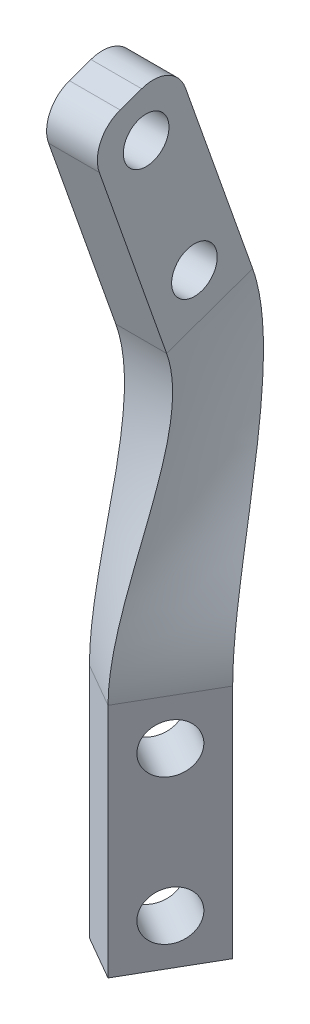
ISO-10303-21;
HEADER;
FILE_DESCRIPTION(('STEP AP214'),'2;1');
FILE_NAME('part.step','',(''),(''),'','','');
FILE_SCHEMA(('AUTOMOTIVE_DESIGN { 1 0 10303 214 1 1 1 1 }'));
ENDSEC;
DATA;
#1=APPLICATION_CONTEXT('core data for automotive mechanical design processes');
#2=APPLICATION_PROTOCOL_DEFINITION('international standard','automotive_design',2000,#1);
#3=PRODUCT_CONTEXT('',#1,'mechanical');
#4=PRODUCT('Part','Part','',(#3));
#5=PRODUCT_RELATED_PRODUCT_CATEGORY('part','',(#4));
#6=PRODUCT_DEFINITION_FORMATION('','',#4);
#7=PRODUCT_DEFINITION_CONTEXT('part definition',#1,'design');
#8=PRODUCT_DEFINITION('design','',#6,#7);
#9=PRODUCT_DEFINITION_SHAPE('','',#8);
#10=(LENGTH_UNIT() NAMED_UNIT(*) SI_UNIT(.MILLI.,.METRE.));
#11=(NAMED_UNIT(*) PLANE_ANGLE_UNIT() SI_UNIT($,.RADIAN.));
#12=(NAMED_UNIT(*) SI_UNIT($,.STERADIAN.) SOLID_ANGLE_UNIT());
#13=UNCERTAINTY_MEASURE_WITH_UNIT(LENGTH_MEASURE(1.E-05),#10,'distance_accuracy_value','');
#14=(GEOMETRIC_REPRESENTATION_CONTEXT(3) GLOBAL_UNCERTAINTY_ASSIGNED_CONTEXT((#13)) GLOBAL_UNIT_ASSIGNED_CONTEXT((#10,
#11,#12)) REPRESENTATION_CONTEXT('',''));
#15=CARTESIAN_POINT('',(0.,0.,0.));
#16=DIRECTION('',(0.,0.,1.));
#17=DIRECTION('',(1.,0.,0.));
#18=AXIS2_PLACEMENT_3D('',#15,#16,#17);
#19=CARTESIAN_POINT('',(-105.348860829014,1.44942155266481E-13,-60.8231931584518));
#20=DIRECTION('',(0.866025403784439,0.,0.5));
#21=DIRECTION('',(-0.5,0.,0.866025403784439));
#22=AXIS2_PLACEMENT_3D('',#19,#20,#21);
#23=PLANE('',#22);
#24=CARTESIAN_POINT('',(-190.650199856967,-33.4932998807614,86.9230599916197));
#25=DIRECTION('',(-0.866025403784438,0.,-0.500000000000001));
#26=DIRECTION('',(-0.500000000000001,0.,0.866025403784438));
#27=AXIS2_PLACEMENT_3D('',#24,#25,#26);
#28=CIRCLE('',#27,2.15000000000004);
#29=CARTESIAN_POINT('',(-191.725199856967,-33.4932998807614,88.7850146097563));
#30=VERTEX_POINT('',#29);
#31=EDGE_CURVE('E276',#30,#30,#28,.T.);
#32=ORIENTED_EDGE('',*,*,#31,.T.);
#33=EDGE_LOOP('',(#32));
#34=FACE_BOUND('',#33,.T.);
#35=DIRECTION('',(0.,-1.,0.));
#36=VECTOR('',#35,1.);
#37=CARTESIAN_POINT('',(-188.650199856967,-16.7932998807614,83.4589583764819));
#38=LINE('',#37,#36);
#39=CARTESIAN_POINT('',(-188.650199856967,-16.7932998807614,83.4589583764819));
#40=VERTEX_POINT('',#39);
#41=CARTESIAN_POINT('',(-188.650199856967,-37.4932998807614,83.4589583764819));
#42=VERTEX_POINT('',#41);
#43=EDGE_CURVE('E286',#40,#42,#38,.T.);
#44=ORIENTED_EDGE('',*,*,#43,.F.);
#45=DIRECTION('',(-0.5,0.,0.866025403784439));
#46=VECTOR('',#45,1.);
#47=CARTESIAN_POINT('',(-105.348860829014,-16.7932998807614,-60.8231931584518));
#48=LINE('',#47,#46);
#49=CARTESIAN_POINT('',(-192.650199856967,-16.7932998807614,90.3871616067574));
#50=VERTEX_POINT('',#49);
#51=EDGE_CURVE('E300',#50,#40,#48,.F.);
#52=ORIENTED_EDGE('',*,*,#51,.F.);
#53=DIRECTION('',(0.,1.,0.));
#54=VECTOR('',#53,1.);
#55=CARTESIAN_POINT('',(-192.650199856967,-16.7932998807614,90.3871616067574));
#56=LINE('',#55,#54);
#57=CARTESIAN_POINT('',(-192.650199856967,-37.4932998807614,90.3871616067574));
#58=VERTEX_POINT('',#57);
#59=EDGE_CURVE('E285',#58,#50,#56,.T.);
#60=ORIENTED_EDGE('',*,*,#59,.F.);
#61=DIRECTION('',(-0.5,0.,0.866025403784439));
#62=VECTOR('',#61,1.);
#63=CARTESIAN_POINT('',(-188.650199856967,-37.4932998807614,83.4589583764819));
#64=LINE('',#63,#62);
#65=EDGE_CURVE('E282',#42,#58,#64,.T.);
#66=ORIENTED_EDGE('',*,*,#65,.F.);
#67=EDGE_LOOP('',(#44,#52,#60,#66));
#68=FACE_BOUND('',#67,.T.);
#69=CARTESIAN_POINT('',(-190.650199856967,-20.7932998807614,86.9230599916197));
#70=DIRECTION('',(-0.866025403784438,0.,-0.500000000000001));
#71=DIRECTION('',(-0.500000000000001,0.,0.866025403784438));
#72=AXIS2_PLACEMENT_3D('',#69,#70,#71);
#73=CIRCLE('',#72,2.15000000000004);
#74=CARTESIAN_POINT('',(-191.725199856967,-20.7932998807614,88.7850146097563));
#75=VERTEX_POINT('',#74);
#76=EDGE_CURVE('E264',#75,#75,#73,.T.);
#77=ORIENTED_EDGE('',*,*,#76,.T.);
#78=EDGE_LOOP('',(#77));
#79=FACE_BOUND('',#78,.T.);
#80=ADVANCED_FACE('F45',(#34,#68,#79),#23,.T.);
#81=CARTESIAN_POINT('',(-109.202673875855,1.46424303004355E-13,-63.0481931584518));
#82=DIRECTION('',(0.866025403784439,0.,0.5));
#83=DIRECTION('',(-0.5,0.,0.866025403784439));
#84=AXIS2_PLACEMENT_3D('',#81,#82,#83);
#85=PLANE('',#84);
#86=DIRECTION('',(0.,-1.,0.));
#87=VECTOR('',#86,1.);
#88=CARTESIAN_POINT('',(-192.504012903807,-16.7932998807614,81.2339583764819));
#89=LINE('',#88,#87);
#90=CARTESIAN_POINT('',(-192.504012903807,-16.7932998807614,81.2339583764819));
#91=VERTEX_POINT('',#90);
#92=CARTESIAN_POINT('',(-192.504012903807,-37.4932998807614,81.2339583764819));
#93=VERTEX_POINT('',#92);
#94=EDGE_CURVE('E279',#91,#93,#89,.T.);
#95=ORIENTED_EDGE('',*,*,#94,.T.);
#96=DIRECTION('',(-0.5,0.,0.866025403784439));
#97=VECTOR('',#96,1.);
#98=CARTESIAN_POINT('',(-192.504012903807,-37.4932998807614,81.2339583764819));
#99=LINE('',#98,#97);
#100=CARTESIAN_POINT('',(-196.504012903807,-37.4932998807614,88.1621616067574));
#101=VERTEX_POINT('',#100);
#102=EDGE_CURVE('E287',#93,#101,#99,.T.);
#103=ORIENTED_EDGE('',*,*,#102,.T.);
#104=DIRECTION('',(0.,1.,0.));
#105=VECTOR('',#104,1.);
#106=CARTESIAN_POINT('',(-196.504012903807,-16.7932998807614,88.1621616067574));
#107=LINE('',#106,#105);
#108=CARTESIAN_POINT('',(-196.504012903807,-16.7932998807614,88.1621616067574));
#109=VERTEX_POINT('',#108);
#110=EDGE_CURVE('E290',#101,#109,#107,.T.);
#111=ORIENTED_EDGE('',*,*,#110,.T.);
#112=DIRECTION('',(-0.5,0.,0.866025403784439));
#113=VECTOR('',#112,1.);
#114=CARTESIAN_POINT('',(-109.202673875855,-16.7932998807614,-63.0481931584518));
#115=LINE('',#114,#113);
#116=EDGE_CURVE('E162',#109,#91,#115,.F.);
#117=ORIENTED_EDGE('',*,*,#116,.T.);
#118=EDGE_LOOP('',(#95,#103,#111,#117));
#119=FACE_BOUND('',#118,.T.);
#120=CARTESIAN_POINT('',(-194.504012903807,-33.4932998807614,84.6980599916197));
#121=DIRECTION('',(-0.866025403784438,0.,-0.500000000000001));
#122=DIRECTION('',(-0.500000000000001,0.,0.866025403784438));
#123=AXIS2_PLACEMENT_3D('',#120,#121,#122);
#124=CIRCLE('',#123,2.15000000000004);
#125=CARTESIAN_POINT('',(-195.579012903807,-33.4932998807614,86.5600146097563));
#126=VERTEX_POINT('',#125);
#127=EDGE_CURVE('E272',#126,#126,#124,.T.);
#128=ORIENTED_EDGE('',*,*,#127,.F.);
#129=EDGE_LOOP('',(#128));
#130=FACE_BOUND('',#129,.T.);
#131=CARTESIAN_POINT('',(-194.504012903807,-20.7932998807614,84.6980599916197));
#132=DIRECTION('',(-0.866025403784438,0.,-0.500000000000001));
#133=DIRECTION('',(-0.500000000000001,0.,0.866025403784438));
#134=AXIS2_PLACEMENT_3D('',#131,#132,#133);
#135=CIRCLE('',#134,2.15000000000004);
#136=CARTESIAN_POINT('',(-195.579012903807,-20.7932998807614,86.5600146097563));
#137=VERTEX_POINT('',#136);
#138=EDGE_CURVE('E273',#137,#137,#135,.T.);
#139=ORIENTED_EDGE('',*,*,#138,.F.);
#140=EDGE_LOOP('',(#139));
#141=FACE_BOUND('',#140,.T.);
#142=ADVANCED_FACE('F379',(#119,#130,#141),#85,.F.);
#143=CARTESIAN_POINT('',(-188.650199856967,-16.7932998807614,83.4589583764819));
#144=DIRECTION('',(-0.500000000000001,0.,0.866025403784438));
#145=DIRECTION('',(-0.866025403784438,0.,-0.500000000000001));
#146=AXIS2_PLACEMENT_3D('',#143,#144,#145);
#147=PLANE('',#146);
#148=ORIENTED_EDGE('',*,*,#94,.F.);
#149=DIRECTION('',(-0.866025403784438,0.,-0.500000000000001));
#150=VECTOR('',#149,1.);
#151=CARTESIAN_POINT('',(-188.650199856967,-16.7932998807614,83.4589583764819));
#152=LINE('',#151,#150);
#153=EDGE_CURVE('E307',#40,#91,#152,.T.);
#154=ORIENTED_EDGE('',*,*,#153,.F.);
#155=ORIENTED_EDGE('',*,*,#43,.T.);
#156=DIRECTION('',(-0.866025403784438,0.,-0.500000000000001));
#157=VECTOR('',#156,1.);
#158=CARTESIAN_POINT('',(-188.650199856967,-37.4932998807614,83.4589583764819));
#159=LINE('',#158,#157);
#160=EDGE_CURVE('E293',#42,#93,#159,.T.);
#161=ORIENTED_EDGE('',*,*,#160,.T.);
#162=EDGE_LOOP('',(#148,#154,#155,#161));
#163=FACE_BOUND('',#162,.T.);
#164=ADVANCED_FACE('F382',(#163),#147,.F.);
#165=CARTESIAN_POINT('',(-188.650199856967,-37.4932998807614,83.4589583764819));
#166=DIRECTION('',(0.,1.,0.));
#167=DIRECTION('',(-1.,0.,0.));
#168=AXIS2_PLACEMENT_3D('',#165,#166,#167);
#169=PLANE('',#168);
#170=ORIENTED_EDGE('',*,*,#102,.F.);
#171=ORIENTED_EDGE('',*,*,#160,.F.);
#172=ORIENTED_EDGE('',*,*,#65,.T.);
#173=DIRECTION('',(-0.866025403784438,0.,-0.500000000000001));
#174=VECTOR('',#173,1.);
#175=CARTESIAN_POINT('',(-192.650199856967,-37.4932998807614,90.3871616067574));
#176=LINE('',#175,#174);
#177=EDGE_CURVE('E291',#58,#101,#176,.T.);
#178=ORIENTED_EDGE('',*,*,#177,.T.);
#179=EDGE_LOOP('',(#170,#171,#172,#178));
#180=FACE_BOUND('',#179,.T.);
#181=ADVANCED_FACE('F387',(#180),#169,.F.);
#182=CARTESIAN_POINT('',(-192.650199856967,-16.7932998807614,90.3871616067574));
#183=DIRECTION('',(0.500000000000001,0.,-0.866025403784438));
#184=DIRECTION('',(0.866025403784438,0.,0.500000000000001));
#185=AXIS2_PLACEMENT_3D('',#182,#183,#184);
#186=PLANE('',#185);
#187=ORIENTED_EDGE('',*,*,#110,.F.);
#188=ORIENTED_EDGE('',*,*,#177,.F.);
#189=ORIENTED_EDGE('',*,*,#59,.T.);
#190=DIRECTION('',(0.866025403784438,0.,0.500000000000001));
#191=VECTOR('',#190,1.);
#192=CARTESIAN_POINT('',(-192.650199856967,-16.7932998807614,90.3871616067574));
#193=LINE('',#192,#191);
#194=EDGE_CURVE('E294',#50,#109,#193,.F.);
#195=ORIENTED_EDGE('',*,*,#194,.T.);
#196=EDGE_LOOP('',(#187,#188,#189,#195));
#197=FACE_BOUND('',#196,.T.);
#198=ADVANCED_FACE('F390',(#197),#186,.F.);
#199=CARTESIAN_POINT('',(-190.650199856967,-33.4932998807614,86.9230599916197));
#200=DIRECTION('',(-0.866025403784438,0.,-0.500000000000001));
#201=DIRECTION('',(0.500000000000001,0.,-0.866025403784438));
#202=AXIS2_PLACEMENT_3D('',#199,#200,#201);
#203=CYLINDRICAL_SURFACE('',#202,2.15000000000004);
#204=ORIENTED_EDGE('',*,*,#31,.F.);
#205=EDGE_LOOP('',(#204));
#206=FACE_BOUND('',#205,.T.);
#207=ORIENTED_EDGE('',*,*,#127,.T.);
#208=EDGE_LOOP('',(#207));
#209=FACE_BOUND('',#208,.T.);
#210=ADVANCED_FACE('F401',(#206,#209),#203,.F.);
#211=CARTESIAN_POINT('',(-190.650199856967,-20.7932998807614,86.9230599916197));
#212=DIRECTION('',(-0.866025403784438,0.,-0.500000000000001));
#213=DIRECTION('',(0.500000000000001,0.,-0.866025403784438));
#214=AXIS2_PLACEMENT_3D('',#211,#212,#213);
#215=CYLINDRICAL_SURFACE('',#214,2.15000000000004);
#216=ORIENTED_EDGE('',*,*,#76,.F.);
#217=EDGE_LOOP('',(#216));
#218=FACE_BOUND('',#217,.T.);
#219=ORIENTED_EDGE('',*,*,#138,.T.);
#220=EDGE_LOOP('',(#219));
#221=FACE_BOUND('',#220,.T.);
#222=ADVANCED_FACE('F220',(#218,#221),#215,.F.);
#223=CARTESIAN_POINT('',(-192.504012903807,-16.7932998807614,81.2339583764819));
#224=CARTESIAN_POINT('',(-192.504012903807,-7.72921785171749,81.2339583764819));
#225=CARTESIAN_POINT('',(-197.091499962125,1.823956161103,74.8153627630829));
#226=CARTESIAN_POINT('',(-197.091499962125,10.0294230832178,77.7164334147975));
#227=CARTESIAN_POINT('',(-191.861710729334,-16.7932998807614,81.6047917098152));
#228=CARTESIAN_POINT('',(-191.861710729334,-7.72222765502537,81.6047917098152));
#229=CARTESIAN_POINT('',(-196.349833295459,1.83290463021864,74.8185265246793));
#230=CARTESIAN_POINT('',(-196.349833295459,10.0294230832178,77.7164334147975));
#231=CARTESIAN_POINT('',(-190.577106380387,-16.7932998807614,82.3464583764819));
#232=CARTESIAN_POINT('',(-190.577106380387,-7.70824726164113,82.3464583764819));
#233=CARTESIAN_POINT('',(-194.866499962125,1.85080156844992,74.8248540478722));
#234=CARTESIAN_POINT('',(-194.866499962125,10.0294230832178,77.7164334147975));
#235=CARTESIAN_POINT('',(-189.29250203144,-16.7932998807614,83.0881250431486));
#236=CARTESIAN_POINT('',(-189.29250203144,-7.68478600371778,83.0881250431486));
#237=CARTESIAN_POINT('',(-193.383166628792,1.85975986187171,74.8280212828854));
#238=CARTESIAN_POINT('',(-193.383166628792,10.0294230832178,77.7164334147975));
#239=CARTESIAN_POINT('',(-188.650199856967,-16.7932998807614,83.4589583764819));
#240=CARTESIAN_POINT('',(-188.650199856967,-7.6730553747561,83.4589583764819));
#241=CARTESIAN_POINT('',(-192.641499962125,1.86423900858261,74.829604900392));
#242=CARTESIAN_POINT('',(-192.641499962125,10.0294230832178,77.7164334147975));
#243=B_SPLINE_SURFACE_WITH_KNOTS('',3,3,((#223,#224,#225,#226),(#227,#228,#229,#230),(#231,#232,
#233,#234),(#235,#236,#237,#238),(#239,#240,#241,#242)),.UNSPECIFIED.,.F.,.F.,.F.,(4,1,4),(4,4),
(0.,0.5,1.),(0.,1.),.UNSPECIFIED.);
#244=CARTESIAN_POINT('',(-192.504012903807,-16.7932998807614,81.2339583764819));
#245=CARTESIAN_POINT('',(-192.504012903807,-7.72921785171749,81.2339583764819));
#246=CARTESIAN_POINT('',(-197.091499962125,1.823956161103,74.8153627630829));
#247=CARTESIAN_POINT('',(-197.091499962125,10.0294230832178,77.7164334147975));
#248=B_SPLINE_CURVE_WITH_KNOTS('',3,(#244,#245,#246,#247),.UNSPECIFIED.,.F.,.F.,(4,4),(0.,1.),.UNSPECIFIED.);
#249=CARTESIAN_POINT('',(-197.091499962125,10.0294230832178,77.7164334147975));
#250=VERTEX_POINT('',#249);
#251=EDGE_CURVE('E176',#250,#91,#248,.F.);
#252=CARTESIAN_POINT('',(-197.091499962125,10.0294230832178,77.7164334147975));
#253=CARTESIAN_POINT('',(-196.349833295459,10.0294230832178,77.7164334147975));
#254=CARTESIAN_POINT('',(-194.866499962125,10.0294230832178,77.7164334147975));
#255=CARTESIAN_POINT('',(-193.383166628792,10.0294230832178,77.7164334147975));
#256=CARTESIAN_POINT('',(-192.641499962125,10.0294230832178,77.7164334147975));
#257=B_SPLINE_CURVE_WITH_KNOTS('',3,(#252,#253,#254,#255,#256),.UNSPECIFIED.,.F.,.F.,(4,1,4),
(0.,0.5,1.),.UNSPECIFIED.);
#258=CARTESIAN_POINT('',(-192.641499962125,10.0294230832178,77.7164334147975));
#259=VERTEX_POINT('',#258);
#260=EDGE_CURVE('E202',#259,#250,#257,.F.);
#261=CARTESIAN_POINT('',(-188.650199856967,-16.7932998807614,83.4589583764819));
#262=CARTESIAN_POINT('',(-188.650199856967,-7.6730553747561,83.4589583764819));
#263=CARTESIAN_POINT('',(-192.641499962125,1.86423900858261,74.829604900392));
#264=CARTESIAN_POINT('',(-192.641499962125,10.0294230832178,77.7164334147975));
#265=B_SPLINE_CURVE_WITH_KNOTS('',3,(#261,#262,#263,#264),.UNSPECIFIED.,.F.,.F.,(4,4),(0.,1.),.UNSPECIFIED.);
#266=EDGE_CURVE('E165',#40,#259,#265,.T.);
#267=ORIENTED_EDGE('',*,*,#153,.T.);
#268=ORIENTED_EDGE('',*,*,#251,.F.);
#269=ORIENTED_EDGE('',*,*,#260,.F.);
#270=ORIENTED_EDGE('',*,*,#266,.F.);
#271=EDGE_LOOP('',(#267,#268,#269,#270));
#272=FACE_BOUND('',#271,.T.);
#273=ADVANCED_FACE('F207',(#272),#243,.F.);
#274=CARTESIAN_POINT('',(-188.650199856967,-16.7932998807614,83.4589583764819));
#275=CARTESIAN_POINT('',(-188.650199856967,-7.6730553747561,83.4589583764819));
#276=CARTESIAN_POINT('',(-192.641499962125,1.86423900858261,74.829604900392));
#277=CARTESIAN_POINT('',(-192.641499962125,10.0294230832178,77.7164334147975));
#278=CARTESIAN_POINT('',(-189.316866523633,-16.7932998807614,84.6136589148612));
#279=CARTESIAN_POINT('',(-189.316866523633,-7.83999542773606,84.6136589148612));
#280=CARTESIAN_POINT('',(-192.641499962125,1.56970197263627,76.139683895051));
#281=CARTESIAN_POINT('',(-192.641499962125,9.58497863877331,78.9735121369069));
#282=CARTESIAN_POINT('',(-190.650199856967,-16.7932998807614,86.9230599916197));
#283=CARTESIAN_POINT('',(-190.650199856967,-8.17387553369598,86.9230599916197));
#284=CARTESIAN_POINT('',(-192.641499962125,0.980627900743588,78.759841884369));
#285=CARTESIAN_POINT('',(-192.641499962125,8.69608974988443,81.4876695811257));
#286=CARTESIAN_POINT('',(-191.9835331903,-16.7932998807614,89.2324610683782));
#287=CARTESIAN_POINT('',(-191.9835331903,-8.48036474063781,89.2324610683782));
#288=CARTESIAN_POINT('',(-192.641499962125,0.365729441599598,81.3708695740142));
#289=CARTESIAN_POINT('',(-192.641499962125,7.80720086099554,84.0018270253446));
#290=CARTESIAN_POINT('',(-192.650199856967,-16.7932998807614,90.3871616067574));
#291=CARTESIAN_POINT('',(-192.650199856967,-8.63360934410873,90.3871616067574));
#292=CARTESIAN_POINT('',(-192.641499962125,0.0582802120276058,82.6763834188368));
#293=CARTESIAN_POINT('',(-192.641499962125,7.3627564165511,85.258905747454));
#294=B_SPLINE_SURFACE_WITH_KNOTS('',3,3,((#274,#275,#276,#277),(#278,#279,#280,#281),(#282,#283,
#284,#285),(#286,#287,#288,#289),(#290,#291,#292,#293)),.UNSPECIFIED.,.F.,.F.,.F.,(4,1,4),(4,4),
(0.,0.5,1.),(0.,1.),.UNSPECIFIED.);
#295=CARTESIAN_POINT('',(-192.641499962125,10.0294230832178,77.7164334147975));
#296=CARTESIAN_POINT('',(-192.641499962125,9.58497863877331,78.9735121369069));
#297=CARTESIAN_POINT('',(-192.641499962125,8.69608974988442,81.4876695811257));
#298=CARTESIAN_POINT('',(-192.641499962125,7.80720086099553,84.0018270253446));
#299=CARTESIAN_POINT('',(-192.641499962125,7.36275641655109,85.258905747454));
#300=B_SPLINE_CURVE_WITH_KNOTS('',3,(#295,#296,#297,#298,#299),.UNSPECIFIED.,.F.,.F.,(4,1,4),
(0.,0.5,1.),.UNSPECIFIED.);
#301=CARTESIAN_POINT('',(-192.641499962125,7.3627564165511,85.258905747454));
#302=VERTEX_POINT('',#301);
#303=EDGE_CURVE('E143',#259,#302,#300,.T.);
#304=CARTESIAN_POINT('',(-192.650199856967,-16.7932998807614,90.3871616067574));
#305=CARTESIAN_POINT('',(-192.650199856967,-8.63360934410873,90.3871616067574));
#306=CARTESIAN_POINT('',(-192.641499962125,0.0582802120276058,82.6763834188368));
#307=CARTESIAN_POINT('',(-192.641499962125,7.3627564165511,85.258905747454));
#308=B_SPLINE_CURVE_WITH_KNOTS('',3,(#304,#305,#306,#307),.UNSPECIFIED.,.F.,.F.,(4,4),(0.,1.),.UNSPECIFIED.);
#309=EDGE_CURVE('E141',#50,#302,#308,.T.);
#310=ORIENTED_EDGE('',*,*,#51,.T.);
#311=ORIENTED_EDGE('',*,*,#266,.T.);
#312=ORIENTED_EDGE('',*,*,#303,.T.);
#313=ORIENTED_EDGE('',*,*,#309,.F.);
#314=EDGE_LOOP('',(#310,#311,#312,#313));
#315=FACE_BOUND('',#314,.T.);
#316=ADVANCED_FACE('F219',(#315),#294,.F.);
#317=CARTESIAN_POINT('',(-196.504012903807,-16.7932998807614,88.1621616067574));
#318=CARTESIAN_POINT('',(-196.504012903807,-8.70509433662134,88.1621616067574));
#319=CARTESIAN_POINT('',(-197.091499962125,0.0324435707494801,82.6672487867114));
#320=CARTESIAN_POINT('',(-197.091499962125,7.3627564165511,85.258905747454));
#321=CARTESIAN_POINT('',(-195.837346237141,-16.7932998807614,87.0074610683782));
#322=CARTESIAN_POINT('',(-195.837346237141,-8.54915338029834,87.0074610683782));
#323=CARTESIAN_POINT('',(-197.091499962125,0.337350654473242,81.3608361576047));
#324=CARTESIAN_POINT('',(-197.091499962125,7.80720086099554,84.0018270253446));
#325=CARTESIAN_POINT('',(-194.504012903807,-16.7932998807614,84.6980599916197));
#326=CARTESIAN_POINT('',(-194.504012903807,-8.23727146765235,84.6980599916197));
#327=CARTESIAN_POINT('',(-197.091499962125,0.947164821920766,78.7480108993914));
#328=CARTESIAN_POINT('',(-197.091499962125,8.69608974988443,81.4876695811257));
#329=CARTESIAN_POINT('',(-193.170679570474,-16.7932998807614,82.3886589148612));
#330=CARTESIAN_POINT('',(-193.170679570474,-7.89856905702911,82.3886589148612));
#331=CARTESIAN_POINT('',(-197.091499962125,1.53169238137558,76.1262454751857));
#332=CARTESIAN_POINT('',(-197.091499962125,9.58497863877331,78.9735121369069));
#333=CARTESIAN_POINT('',(-192.504012903807,-16.7932998807614,81.2339583764819));
#334=CARTESIAN_POINT('',(-192.504012903807,-7.72921785171749,81.2339583764819));
#335=CARTESIAN_POINT('',(-197.091499962125,1.823956161103,74.8153627630829));
#336=CARTESIAN_POINT('',(-197.091499962125,10.0294230832178,77.7164334147975));
#337=B_SPLINE_SURFACE_WITH_KNOTS('',3,3,((#317,#318,#319,#320),(#321,#322,#323,#324),(#325,#326,
#327,#328),(#329,#330,#331,#332),(#333,#334,#335,#336)),.UNSPECIFIED.,.F.,.F.,.F.,(4,1,4),(4,4),
(0.,0.5,1.),(0.,1.),.UNSPECIFIED.);
#338=CARTESIAN_POINT('',(-196.504012903807,-16.7932998807614,88.1621616067574));
#339=CARTESIAN_POINT('',(-196.504012903807,-8.70509433662134,88.1621616067574));
#340=CARTESIAN_POINT('',(-197.091499962125,0.032443570749479,82.6672487867114));
#341=CARTESIAN_POINT('',(-197.091499962125,7.3627564165511,85.258905747454));
#342=B_SPLINE_CURVE_WITH_KNOTS('',3,(#338,#339,#340,#341),.UNSPECIFIED.,.F.,.F.,(4,4),(0.,1.),.UNSPECIFIED.);
#343=CARTESIAN_POINT('',(-197.091499962125,7.3627564165511,85.258905747454));
#344=VERTEX_POINT('',#343);
#345=EDGE_CURVE('E139',#109,#344,#342,.T.);
#346=CARTESIAN_POINT('',(-197.091499962125,7.36275641655109,85.258905747454));
#347=CARTESIAN_POINT('',(-197.091499962125,7.80720086099554,84.0018270253446));
#348=CARTESIAN_POINT('',(-197.091499962125,8.69608974988442,81.4876695811257));
#349=CARTESIAN_POINT('',(-197.091499962125,9.58497863877331,78.9735121369069));
#350=CARTESIAN_POINT('',(-197.091499962125,10.0294230832178,77.7164334147975));
#351=B_SPLINE_CURVE_WITH_KNOTS('',3,(#346,#347,#348,#349,#350),.UNSPECIFIED.,.F.,.F.,(4,1,4),
(0.,0.5,1.),.UNSPECIFIED.);
#352=EDGE_CURVE('E144',#250,#344,#351,.F.);
#353=ORIENTED_EDGE('',*,*,#116,.F.);
#354=ORIENTED_EDGE('',*,*,#345,.T.);
#355=ORIENTED_EDGE('',*,*,#352,.F.);
#356=ORIENTED_EDGE('',*,*,#251,.T.);
#357=EDGE_LOOP('',(#353,#354,#355,#356));
#358=FACE_BOUND('',#357,.T.);
#359=ADVANCED_FACE('F160',(#358),#337,.F.);
#360=CARTESIAN_POINT('',(-192.650199856967,-16.7932998807614,90.3871616067574));
#361=CARTESIAN_POINT('',(-192.650199856967,-8.63360934410873,90.3871616067574));
#362=CARTESIAN_POINT('',(-192.641499962125,0.0582802120276058,82.6763834188368));
#363=CARTESIAN_POINT('',(-192.641499962125,7.3627564165511,85.258905747454));
#364=CARTESIAN_POINT('',(-193.29250203144,-16.7932998807614,90.0163282734241));
#365=CARTESIAN_POINT('',(-193.29250203144,-8.64816523615713,90.0163282734241));
#366=CARTESIAN_POINT('',(-193.383166628792,0.0564647488997215,82.6757415556925));
#367=CARTESIAN_POINT('',(-193.383166628792,7.3627564165511,85.258905747454));
#368=CARTESIAN_POINT('',(-194.577106380387,-16.7932998807614,89.2746616067574));
#369=CARTESIAN_POINT('',(-194.577106380387,-8.67727702025393,89.2746616067574));
#370=CARTESIAN_POINT('',(-194.866499962125,0.0528338226439551,82.6744578294037));
#371=CARTESIAN_POINT('',(-194.866499962125,7.3627564165511,85.258905747454));
#372=CARTESIAN_POINT('',(-195.861710729334,-16.7932998807614,88.5329949400908));
#373=CARTESIAN_POINT('',(-195.861710729334,-8.6958218978322,88.5329949400908));
#374=CARTESIAN_POINT('',(-196.349833295459,0.0392403213809699,82.6696518009422));
#375=CARTESIAN_POINT('',(-196.349833295459,7.3627564165511,85.258905747454));
#376=CARTESIAN_POINT('',(-196.504012903807,-16.7932998807614,88.1621616067574));
#377=CARTESIAN_POINT('',(-196.504012903807,-8.70509433662134,88.1621616067574));
#378=CARTESIAN_POINT('',(-197.091499962125,0.032443570749479,82.6672487867114));
#379=CARTESIAN_POINT('',(-197.091499962125,7.3627564165511,85.258905747454));
#380=B_SPLINE_SURFACE_WITH_KNOTS('',3,3,((#360,#361,#362,#363),(#364,#365,#366,#367),(#368,#369,
#370,#371),(#372,#373,#374,#375),(#376,#377,#378,#379)),.UNSPECIFIED.,.F.,.F.,.F.,(4,1,4),(4,4),
(0.,0.5,1.),(0.,1.),.UNSPECIFIED.);
#381=CARTESIAN_POINT('',(-192.641499962125,7.3627564165511,85.258905747454));
#382=CARTESIAN_POINT('',(-193.383166628792,7.3627564165511,85.258905747454));
#383=CARTESIAN_POINT('',(-194.866499962125,7.3627564165511,85.258905747454));
#384=CARTESIAN_POINT('',(-196.349833295459,7.3627564165511,85.258905747454));
#385=CARTESIAN_POINT('',(-197.091499962125,7.3627564165511,85.258905747454));
#386=B_SPLINE_CURVE_WITH_KNOTS('',3,(#381,#382,#383,#384,#385),.UNSPECIFIED.,.F.,.F.,(4,1,4),
(0.,0.5,1.),.UNSPECIFIED.);
#387=EDGE_CURVE('E125',#302,#344,#386,.T.);
#388=ORIENTED_EDGE('',*,*,#194,.F.);
#389=ORIENTED_EDGE('',*,*,#309,.T.);
#390=ORIENTED_EDGE('',*,*,#387,.T.);
#391=ORIENTED_EDGE('',*,*,#345,.F.);
#392=EDGE_LOOP('',(#388,#389,#390,#391));
#393=FACE_BOUND('',#392,.T.);
#394=ADVANCED_FACE('F137',(#393),#380,.F.);
#395=CARTESIAN_POINT('',(-192.641499962125,0.,0.));
#396=DIRECTION('',(1.,0.,0.));
#397=DIRECTION('',(0.,0.,1.));
#398=AXIS2_PLACEMENT_3D('',#395,#396,#397);
#399=PLANE('',#398);
#400=CARTESIAN_POINT('',(-192.641499962125,24.4410007442855,87.0543362477855));
#401=DIRECTION('',(-1.,0.,0.));
#402=DIRECTION('',(0.,1.,0.));
#403=AXIS2_PLACEMENT_3D('',#400,#401,#402);
#404=CIRCLE('',#403,1.99999999963518);
#405=CARTESIAN_POINT('',(-192.641499962125,26.4410007439207,87.0543362477855));
#406=VERTEX_POINT('',#405);
#407=EDGE_CURVE('E132',#406,#406,#404,.T.);
#408=ORIENTED_EDGE('',*,*,#407,.T.);
#409=EDGE_LOOP('',(#408));
#410=FACE_BOUND('',#409,.T.);
#411=DIRECTION('',(0.,0.333333333333332,-0.942809041582064));
#412=VECTOR('',#411,1.);
#413=CARTESIAN_POINT('',(-192.641499962125,26.8789035772804,92.1589057474471));
#414=LINE('',#413,#412);
#415=CARTESIAN_POINT('',(-192.641499962125,27.8789035772804,89.3304786227009));
#416=VERTEX_POINT('',#415);
#417=CARTESIAN_POINT('',(-192.641499962125,28.5455702439471,87.4448605395368));
#418=VERTEX_POINT('',#417);
#419=EDGE_CURVE('E324',#416,#418,#414,.T.);
#420=ORIENTED_EDGE('',*,*,#419,.F.);
#421=CARTESIAN_POINT('',(-192.641499962125,25.0504764525342,88.3304786227009));
#422=DIRECTION('',(-1.,0.,0.));
#423=DIRECTION('',(0.,0.,1.));
#424=AXIS2_PLACEMENT_3D('',#421,#422,#423);
#425=CIRCLE('',#424,3.);
#426=CARTESIAN_POINT('',(-192.641499962125,24.0504764525342,91.1589057474471));
#427=VERTEX_POINT('',#426);
#428=EDGE_CURVE('E609',#427,#416,#425,.T.);
#429=ORIENTED_EDGE('',*,*,#428,.F.);
#430=DIRECTION('',(0.,0.942809041582063,0.333333333333333));
#431=VECTOR('',#430,1.);
#432=CARTESIAN_POINT('',(-192.641499962125,7.3627564165511,85.258905747454));
#433=LINE('',#432,#431);
#434=EDGE_CURVE('E317',#302,#427,#433,.T.);
#435=ORIENTED_EDGE('',*,*,#434,.F.);
#436=ORIENTED_EDGE('',*,*,#303,.F.);
#437=DIRECTION('',(0.,-0.942809041582064,-0.333333333333332));
#438=VECTOR('',#437,1.);
#439=CARTESIAN_POINT('',(-192.641499962125,29.5455702439471,84.6164334147906));
#440=LINE('',#439,#438);
#441=CARTESIAN_POINT('',(-192.641499962125,26.7171431192009,83.6164334147906));
#442=VERTEX_POINT('',#441);
#443=EDGE_CURVE('E181',#442,#259,#440,.T.);
#444=ORIENTED_EDGE('',*,*,#443,.F.);
#445=CARTESIAN_POINT('',(-192.641499962125,25.7171431192009,86.4448605395368));
#446=DIRECTION('',(-1.,0.,0.));
#447=DIRECTION('',(0.,0.,1.));
#448=AXIS2_PLACEMENT_3D('',#445,#446,#447);
#449=CIRCLE('',#448,3.);
#450=EDGE_CURVE('E53',#418,#442,#449,.T.);
#451=ORIENTED_EDGE('',*,*,#450,.F.);
#452=EDGE_LOOP('',(#420,#429,#435,#436,#444,#451));
#453=FACE_BOUND('',#452,.T.);
#454=CARTESIAN_POINT('',(-192.641499962125,12.4673259162127,82.8210029144591));
#455=DIRECTION('',(-1.,0.,0.));
#456=DIRECTION('',(0.,1.,0.));
#457=AXIS2_PLACEMENT_3D('',#454,#455,#456);
#458=CIRCLE('',#457,1.99999999962298);
#459=CARTESIAN_POINT('',(-192.641499962125,14.4673259158357,82.8210029144591));
#460=VERTEX_POINT('',#459);
#461=EDGE_CURVE('E760',#460,#460,#458,.T.);
#462=ORIENTED_EDGE('',*,*,#461,.T.);
#463=EDGE_LOOP('',(#462));
#464=FACE_BOUND('',#463,.T.);
#465=ADVANCED_FACE('F337',(#410,#453,#464),#399,.T.);
#466=CARTESIAN_POINT('',(-197.091499962125,0.,0.));
#467=DIRECTION('',(1.,0.,0.));
#468=DIRECTION('',(0.,0.,1.));
#469=AXIS2_PLACEMENT_3D('',#466,#467,#468);
#470=PLANE('',#469);
#471=DIRECTION('',(0.,-0.942809041582064,-0.333333333333332));
#472=VECTOR('',#471,1.);
#473=CARTESIAN_POINT('',(-197.091499962125,29.5455702439471,84.6164334147906));
#474=LINE('',#473,#472);
#475=CARTESIAN_POINT('',(-197.091499962125,26.7171431192009,83.6164334147906));
#476=VERTEX_POINT('',#475);
#477=EDGE_CURVE('E153',#476,#250,#474,.T.);
#478=ORIENTED_EDGE('',*,*,#477,.T.);
#479=ORIENTED_EDGE('',*,*,#352,.T.);
#480=DIRECTION('',(0.,0.942809041582063,0.333333333333333));
#481=VECTOR('',#480,1.);
#482=CARTESIAN_POINT('',(-197.091499962125,7.3627564165511,85.258905747454));
#483=LINE('',#482,#481);
#484=CARTESIAN_POINT('',(-197.091499962125,24.0504764525342,91.1589057474471));
#485=VERTEX_POINT('',#484);
#486=EDGE_CURVE('E122',#344,#485,#483,.T.);
#487=ORIENTED_EDGE('',*,*,#486,.T.);
#488=CARTESIAN_POINT('',(-197.091499962125,25.0504764525342,88.3304786227009));
#489=DIRECTION('',(-1.,0.,0.));
#490=DIRECTION('',(0.,0.,1.));
#491=AXIS2_PLACEMENT_3D('',#488,#489,#490);
#492=CIRCLE('',#491,3.);
#493=CARTESIAN_POINT('',(-197.091499962125,27.8789035772804,89.3304786227009));
#494=VERTEX_POINT('',#493);
#495=EDGE_CURVE('E620',#494,#485,#492,.F.);
#496=ORIENTED_EDGE('',*,*,#495,.F.);
#497=DIRECTION('',(0.,0.333333333333332,-0.942809041582064));
#498=VECTOR('',#497,1.);
#499=CARTESIAN_POINT('',(-197.091499962125,26.8789035772804,92.1589057474471));
#500=LINE('',#499,#498);
#501=CARTESIAN_POINT('',(-197.091499962125,28.5455702439471,87.4448605395368));
#502=VERTEX_POINT('',#501);
#503=EDGE_CURVE('E131',#494,#502,#500,.T.);
#504=ORIENTED_EDGE('',*,*,#503,.T.);
#505=CARTESIAN_POINT('',(-197.091499962125,25.7171431192009,86.4448605395368));
#506=DIRECTION('',(-1.,0.,0.));
#507=DIRECTION('',(0.,0.,1.));
#508=AXIS2_PLACEMENT_3D('',#505,#506,#507);
#509=CIRCLE('',#508,3.);
#510=EDGE_CURVE('E619',#476,#502,#509,.F.);
#511=ORIENTED_EDGE('',*,*,#510,.F.);
#512=EDGE_LOOP('',(#478,#479,#487,#496,#504,#511));
#513=FACE_BOUND('',#512,.T.);
#514=CARTESIAN_POINT('',(-197.091499962125,24.4410007442855,87.0543362477855));
#515=DIRECTION('',(-1.,0.,0.));
#516=DIRECTION('',(0.,1.,0.));
#517=AXIS2_PLACEMENT_3D('',#514,#515,#516);
#518=CIRCLE('',#517,1.99999999963518);
#519=CARTESIAN_POINT('',(-197.091499962125,26.4410007439207,87.0543362477855));
#520=VERTEX_POINT('',#519);
#521=EDGE_CURVE('E615',#520,#520,#518,.T.);
#522=ORIENTED_EDGE('',*,*,#521,.F.);
#523=EDGE_LOOP('',(#522));
#524=FACE_BOUND('',#523,.T.);
#525=CARTESIAN_POINT('',(-197.091499962125,12.4673259162127,82.8210029144591));
#526=DIRECTION('',(-1.,0.,0.));
#527=DIRECTION('',(0.,1.,0.));
#528=AXIS2_PLACEMENT_3D('',#525,#526,#527);
#529=CIRCLE('',#528,1.99999999962298);
#530=CARTESIAN_POINT('',(-197.091499962125,14.4673259158357,82.8210029144591));
#531=VERTEX_POINT('',#530);
#532=EDGE_CURVE('E762',#531,#531,#529,.T.);
#533=ORIENTED_EDGE('',*,*,#532,.F.);
#534=EDGE_LOOP('',(#533));
#535=FACE_BOUND('',#534,.T.);
#536=ADVANCED_FACE('F149',(#513,#524,#535),#470,.F.);
#537=CARTESIAN_POINT('',(-192.641499962125,7.3627564165511,85.258905747454));
#538=DIRECTION('',(0.,0.333333333333333,-0.942809041582064));
#539=DIRECTION('',(0.,-0.942809041582064,-0.333333333333333));
#540=AXIS2_PLACEMENT_3D('',#537,#538,#539);
#541=PLANE('',#540);
#542=ORIENTED_EDGE('',*,*,#486,.F.);
#543=ORIENTED_EDGE('',*,*,#387,.F.);
#544=ORIENTED_EDGE('',*,*,#434,.T.);
#545=DIRECTION('',(-1.,0.,0.));
#546=VECTOR('',#545,1.);
#547=CARTESIAN_POINT('',(-192.641499962125,24.0504764525342,91.1589057474471));
#548=LINE('',#547,#546);
#549=EDGE_CURVE('E12',#485,#427,#548,.F.);
#550=ORIENTED_EDGE('',*,*,#549,.F.);
#551=EDGE_LOOP('',(#542,#543,#544,#550));
#552=FACE_BOUND('',#551,.T.);
#553=ADVANCED_FACE('F124',(#552),#541,.F.);
#554=CARTESIAN_POINT('',(-192.641499962125,26.8789035772804,92.1589057474471));
#555=DIRECTION('',(0.,-0.942809041582064,-0.333333333333332));
#556=DIRECTION('',(0.,-0.333333333333332,0.942809041582064));
#557=AXIS2_PLACEMENT_3D('',#554,#555,#556);
#558=PLANE('',#557);
#559=ORIENTED_EDGE('',*,*,#503,.F.);
#560=DIRECTION('',(-1.,0.,0.));
#561=VECTOR('',#560,1.);
#562=CARTESIAN_POINT('',(-192.641499962125,27.8789035772804,89.3304786227009));
#563=LINE('',#562,#561);
#564=EDGE_CURVE('E622',#416,#494,#563,.T.);
#565=ORIENTED_EDGE('',*,*,#564,.F.);
#566=ORIENTED_EDGE('',*,*,#419,.T.);
#567=DIRECTION('',(-1.,0.,0.));
#568=VECTOR('',#567,1.);
#569=CARTESIAN_POINT('',(-192.641499962125,28.5455702439471,87.4448605395368));
#570=LINE('',#569,#568);
#571=EDGE_CURVE('E66',#502,#418,#570,.F.);
#572=ORIENTED_EDGE('',*,*,#571,.F.);
#573=EDGE_LOOP('',(#559,#565,#566,#572));
#574=FACE_BOUND('',#573,.T.);
#575=ADVANCED_FACE('F621',(#574),#558,.F.);
#576=CARTESIAN_POINT('',(-192.641499962125,29.5455702439471,84.6164334147906));
#577=DIRECTION('',(0.,-0.333333333333332,0.942809041582064));
#578=DIRECTION('',(0.,0.942809041582064,0.333333333333332));
#579=AXIS2_PLACEMENT_3D('',#576,#577,#578);
#580=PLANE('',#579);
#581=ORIENTED_EDGE('',*,*,#443,.T.);
#582=ORIENTED_EDGE('',*,*,#260,.T.);
#583=ORIENTED_EDGE('',*,*,#477,.F.);
#584=DIRECTION('',(-1.,0.,0.));
#585=VECTOR('',#584,1.);
#586=CARTESIAN_POINT('',(-192.641499962125,26.7171431192009,83.6164334147906));
#587=LINE('',#586,#585);
#588=EDGE_CURVE('E296',#442,#476,#587,.T.);
#589=ORIENTED_EDGE('',*,*,#588,.F.);
#590=EDGE_LOOP('',(#581,#582,#583,#589));
#591=FACE_BOUND('',#590,.T.);
#592=ADVANCED_FACE('F353',(#591),#580,.F.);
#593=CARTESIAN_POINT('',(-192.641499962125,24.4410007442855,87.0543362477855));
#594=DIRECTION('',(-1.,0.,0.));
#595=DIRECTION('',(0.,-1.,0.));
#596=AXIS2_PLACEMENT_3D('',#593,#594,#595);
#597=CYLINDRICAL_SURFACE('',#596,1.99999999963518);
#598=ORIENTED_EDGE('',*,*,#407,.F.);
#599=EDGE_LOOP('',(#598));
#600=FACE_BOUND('',#599,.T.);
#601=ORIENTED_EDGE('',*,*,#521,.T.);
#602=EDGE_LOOP('',(#601));
#603=FACE_BOUND('',#602,.T.);
#604=ADVANCED_FACE('F348',(#600,#603),#597,.F.);
#605=CARTESIAN_POINT('',(-192.641499962125,12.4673259162127,82.8210029144591));
#606=DIRECTION('',(-1.,0.,0.));
#607=DIRECTION('',(0.,-1.,0.));
#608=AXIS2_PLACEMENT_3D('',#605,#606,#607);
#609=CYLINDRICAL_SURFACE('',#608,1.99999999962298);
#610=ORIENTED_EDGE('',*,*,#461,.F.);
#611=EDGE_LOOP('',(#610));
#612=FACE_BOUND('',#611,.T.);
#613=ORIENTED_EDGE('',*,*,#532,.T.);
#614=EDGE_LOOP('',(#613));
#615=FACE_BOUND('',#614,.T.);
#616=ADVANCED_FACE('F601',(#612,#615),#609,.F.);
#617=CARTESIAN_POINT('',(-192.641499962125,25.7171431192009,86.4448605395368));
#618=DIRECTION('',(-1.,0.,0.));
#619=DIRECTION('',(0.,-1.,0.));
#620=AXIS2_PLACEMENT_3D('',#617,#618,#619);
#621=CYLINDRICAL_SURFACE('',#620,3.);
#622=ORIENTED_EDGE('',*,*,#450,.T.);
#623=ORIENTED_EDGE('',*,*,#588,.T.);
#624=ORIENTED_EDGE('',*,*,#510,.T.);
#625=ORIENTED_EDGE('',*,*,#571,.T.);
#626=EDGE_LOOP('',(#622,#623,#624,#625));
#627=FACE_BOUND('',#626,.T.);
#628=ADVANCED_FACE('F477',(#627),#621,.T.);
#629=CARTESIAN_POINT('',(-192.641499962125,25.0504764525342,88.3304786227009));
#630=DIRECTION('',(-1.,0.,0.));
#631=DIRECTION('',(0.,-1.,0.));
#632=AXIS2_PLACEMENT_3D('',#629,#630,#631);
#633=CYLINDRICAL_SURFACE('',#632,3.);
#634=ORIENTED_EDGE('',*,*,#428,.T.);
#635=ORIENTED_EDGE('',*,*,#564,.T.);
#636=ORIENTED_EDGE('',*,*,#495,.T.);
#637=ORIENTED_EDGE('',*,*,#549,.T.);
#638=EDGE_LOOP('',(#634,#635,#636,#637));
#639=FACE_BOUND('',#638,.T.);
#640=ADVANCED_FACE('F47',(#639),#633,.T.);
#641=CLOSED_SHELL('',(#80,#142,#164,#181,#198,#210,#222,#273,#316,#359,#394,#465,#536,#553,#575,
#592,#604,#616,#628,#640));
#642=MANIFOLD_SOLID_BREP('B2',#641);
#643=ADVANCED_BREP_SHAPE_REPRESENTATION('',(#18,#642),#14);
#644=SHAPE_DEFINITION_REPRESENTATION(#9,#643);
ENDSEC;
END-ISO-10303-21;
